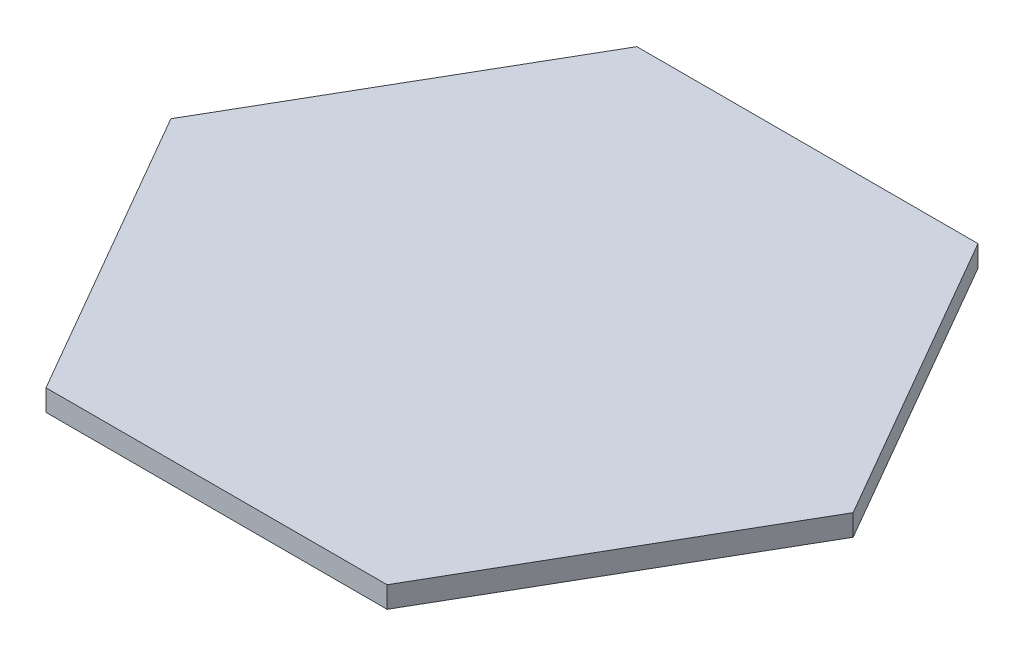
ISO-10303-21;
HEADER;
FILE_DESCRIPTION(('STEP AP214'),'2;1');
FILE_NAME('part.step','',(''),(''),'','','');
FILE_SCHEMA(('AUTOMOTIVE_DESIGN { 1 0 10303 214 1 1 1 1 }'));
ENDSEC;
DATA;
#1=APPLICATION_CONTEXT('core data for automotive mechanical design processes');
#2=APPLICATION_PROTOCOL_DEFINITION('international standard','automotive_design',2000,#1);
#3=PRODUCT_CONTEXT('',#1,'mechanical');
#4=PRODUCT('Part','Part','',(#3));
#5=PRODUCT_RELATED_PRODUCT_CATEGORY('part','',(#4));
#6=PRODUCT_DEFINITION_FORMATION('','',#4);
#7=PRODUCT_DEFINITION_CONTEXT('part definition',#1,'design');
#8=PRODUCT_DEFINITION('design','',#6,#7);
#9=PRODUCT_DEFINITION_SHAPE('','',#8);
#10=(LENGTH_UNIT() NAMED_UNIT(*) SI_UNIT(.MILLI.,.METRE.));
#11=(NAMED_UNIT(*) PLANE_ANGLE_UNIT() SI_UNIT($,.RADIAN.));
#12=(NAMED_UNIT(*) SI_UNIT($,.STERADIAN.) SOLID_ANGLE_UNIT());
#13=UNCERTAINTY_MEASURE_WITH_UNIT(LENGTH_MEASURE(1.E-05),#10,'distance_accuracy_value','');
#14=(GEOMETRIC_REPRESENTATION_CONTEXT(3) GLOBAL_UNCERTAINTY_ASSIGNED_CONTEXT((#13)) GLOBAL_UNIT_ASSIGNED_CONTEXT((#10,
#11,#12)) REPRESENTATION_CONTEXT('',''));
#15=CARTESIAN_POINT('',(0.,0.,0.));
#16=DIRECTION('',(0.,0.,1.));
#17=DIRECTION('',(1.,0.,0.));
#18=AXIS2_PLACEMENT_3D('',#15,#16,#17);
#19=CARTESIAN_POINT('',(25.4,3.175,43.9940905122495));
#20=DIRECTION('',(-0.866025403784439,0.,-0.5));
#21=DIRECTION('',(-0.5,0.,0.866025403784439));
#22=AXIS2_PLACEMENT_3D('',#19,#20,#21);
#23=PLANE('',#22);
#24=DIRECTION('',(0.5,0.,-0.866025403784439));
#25=VECTOR('',#24,1.);
#26=CARTESIAN_POINT('',(25.4,0.,43.9940905122495));
#27=LINE('',#26,#25);
#28=CARTESIAN_POINT('',(25.4,0.,43.9940905122495));
#29=VERTEX_POINT('',#28);
#30=CARTESIAN_POINT('',(50.8,0.,0.));
#31=VERTEX_POINT('',#30);
#32=EDGE_CURVE('E119',#29,#31,#27,.T.);
#33=ORIENTED_EDGE('',*,*,#32,.T.);
#34=DIRECTION('',(0.,-1.,0.));
#35=VECTOR('',#34,1.);
#36=CARTESIAN_POINT('',(50.8,3.175,0.));
#37=LINE('',#36,#35);
#38=CARTESIAN_POINT('',(50.8,3.175,0.));
#39=VERTEX_POINT('',#38);
#40=EDGE_CURVE('E11',#39,#31,#37,.T.);
#41=ORIENTED_EDGE('',*,*,#40,.F.);
#42=DIRECTION('',(0.5,0.,-0.866025403784439));
#43=VECTOR('',#42,1.);
#44=CARTESIAN_POINT('',(25.4,3.175,43.9940905122495));
#45=LINE('',#44,#43);
#46=CARTESIAN_POINT('',(25.4,3.175,43.9940905122495));
#47=VERTEX_POINT('',#46);
#48=EDGE_CURVE('E129',#47,#39,#45,.T.);
#49=ORIENTED_EDGE('',*,*,#48,.F.);
#50=DIRECTION('',(0.,-1.,0.));
#51=VECTOR('',#50,1.);
#52=CARTESIAN_POINT('',(25.4,3.175,43.9940905122495));
#53=LINE('',#52,#51);
#54=EDGE_CURVE('E115',#47,#29,#53,.T.);
#55=ORIENTED_EDGE('',*,*,#54,.T.);
#56=EDGE_LOOP('',(#33,#41,#49,#55));
#57=FACE_BOUND('',#56,.T.);
#58=ADVANCED_FACE('F35',(#57),#23,.F.);
#59=CARTESIAN_POINT('',(50.8,3.175,0.));
#60=DIRECTION('',(-0.866025403784439,0.,0.5));
#61=DIRECTION('',(0.5,0.,0.866025403784439));
#62=AXIS2_PLACEMENT_3D('',#59,#60,#61);
#63=PLANE('',#62);
#64=DIRECTION('',(-0.5,0.,-0.866025403784439));
#65=VECTOR('',#64,1.);
#66=CARTESIAN_POINT('',(50.8,0.,0.));
#67=LINE('',#66,#65);
#68=CARTESIAN_POINT('',(25.4,0.,-43.9940905122495));
#69=VERTEX_POINT('',#68);
#70=EDGE_CURVE('E122',#31,#69,#67,.T.);
#71=ORIENTED_EDGE('',*,*,#70,.T.);
#72=DIRECTION('',(0.,-1.,0.));
#73=VECTOR('',#72,1.);
#74=CARTESIAN_POINT('',(25.4,3.175,-43.9940905122495));
#75=LINE('',#74,#73);
#76=CARTESIAN_POINT('',(25.4,3.175,-43.9940905122495));
#77=VERTEX_POINT('',#76);
#78=EDGE_CURVE('E43',#77,#69,#75,.T.);
#79=ORIENTED_EDGE('',*,*,#78,.F.);
#80=DIRECTION('',(-0.5,0.,-0.866025403784439));
#81=VECTOR('',#80,1.);
#82=CARTESIAN_POINT('',(50.8,3.175,0.));
#83=LINE('',#82,#81);
#84=EDGE_CURVE('E88',#39,#77,#83,.T.);
#85=ORIENTED_EDGE('',*,*,#84,.F.);
#86=ORIENTED_EDGE('',*,*,#40,.T.);
#87=EDGE_LOOP('',(#71,#79,#85,#86));
#88=FACE_BOUND('',#87,.T.);
#89=ADVANCED_FACE('F153',(#88),#63,.F.);
#90=CARTESIAN_POINT('',(25.4,3.175,-43.9940905122495));
#91=DIRECTION('',(0.,0.,1.));
#92=DIRECTION('',(1.,0.,0.));
#93=AXIS2_PLACEMENT_3D('',#90,#91,#92);
#94=PLANE('',#93);
#95=DIRECTION('',(-1.,0.,0.));
#96=VECTOR('',#95,1.);
#97=CARTESIAN_POINT('',(25.4,0.,-43.9940905122495));
#98=LINE('',#97,#96);
#99=CARTESIAN_POINT('',(-25.4,0.,-43.9940905122495));
#100=VERTEX_POINT('',#99);
#101=EDGE_CURVE('E124',#69,#100,#98,.T.);
#102=ORIENTED_EDGE('',*,*,#101,.T.);
#103=DIRECTION('',(0.,-1.,0.));
#104=VECTOR('',#103,1.);
#105=CARTESIAN_POINT('',(-25.4,3.175,-43.9940905122495));
#106=LINE('',#105,#104);
#107=CARTESIAN_POINT('',(-25.4,3.175,-43.9940905122495));
#108=VERTEX_POINT('',#107);
#109=EDGE_CURVE('E110',#108,#100,#106,.T.);
#110=ORIENTED_EDGE('',*,*,#109,.F.);
#111=DIRECTION('',(-1.,0.,0.));
#112=VECTOR('',#111,1.);
#113=CARTESIAN_POINT('',(25.4,3.175,-43.9940905122495));
#114=LINE('',#113,#112);
#115=EDGE_CURVE('E101',#77,#108,#114,.T.);
#116=ORIENTED_EDGE('',*,*,#115,.F.);
#117=ORIENTED_EDGE('',*,*,#78,.T.);
#118=EDGE_LOOP('',(#102,#110,#116,#117));
#119=FACE_BOUND('',#118,.T.);
#120=ADVANCED_FACE('F135',(#119),#94,.F.);
#121=CARTESIAN_POINT('',(-25.4,3.175,-43.9940905122495));
#122=DIRECTION('',(0.866025403784439,0.,0.5));
#123=DIRECTION('',(0.5,0.,-0.866025403784439));
#124=AXIS2_PLACEMENT_3D('',#121,#122,#123);
#125=PLANE('',#124);
#126=DIRECTION('',(-0.5,0.,0.866025403784439));
#127=VECTOR('',#126,1.);
#128=CARTESIAN_POINT('',(-25.4,0.,-43.9940905122495));
#129=LINE('',#128,#127);
#130=CARTESIAN_POINT('',(-50.8,0.,0.));
#131=VERTEX_POINT('',#130);
#132=EDGE_CURVE('E109',#100,#131,#129,.T.);
#133=ORIENTED_EDGE('',*,*,#132,.T.);
#134=DIRECTION('',(0.,-1.,0.));
#135=VECTOR('',#134,1.);
#136=CARTESIAN_POINT('',(-50.8,3.175,0.));
#137=LINE('',#136,#135);
#138=CARTESIAN_POINT('',(-50.8,3.175,0.));
#139=VERTEX_POINT('',#138);
#140=EDGE_CURVE('E106',#139,#131,#137,.T.);
#141=ORIENTED_EDGE('',*,*,#140,.F.);
#142=DIRECTION('',(-0.5,0.,0.866025403784439));
#143=VECTOR('',#142,1.);
#144=CARTESIAN_POINT('',(-25.4,3.175,-43.9940905122495));
#145=LINE('',#144,#143);
#146=EDGE_CURVE('E95',#108,#139,#145,.T.);
#147=ORIENTED_EDGE('',*,*,#146,.F.);
#148=ORIENTED_EDGE('',*,*,#109,.T.);
#149=EDGE_LOOP('',(#133,#141,#147,#148));
#150=FACE_BOUND('',#149,.T.);
#151=ADVANCED_FACE('F107',(#150),#125,.F.);
#152=CARTESIAN_POINT('',(-50.8,3.175,0.));
#153=DIRECTION('',(0.866025403784439,0.,-0.5));
#154=DIRECTION('',(-0.5,0.,-0.866025403784439));
#155=AXIS2_PLACEMENT_3D('',#152,#153,#154);
#156=PLANE('',#155);
#157=DIRECTION('',(0.5,0.,0.866025403784438));
#158=VECTOR('',#157,1.);
#159=CARTESIAN_POINT('',(-50.8,0.,0.));
#160=LINE('',#159,#158);
#161=CARTESIAN_POINT('',(-25.4,0.,43.9940905122495));
#162=VERTEX_POINT('',#161);
#163=EDGE_CURVE('E74',#131,#162,#160,.T.);
#164=ORIENTED_EDGE('',*,*,#163,.T.);
#165=DIRECTION('',(0.,-1.,0.));
#166=VECTOR('',#165,1.);
#167=CARTESIAN_POINT('',(-25.4,3.175,43.9940905122495));
#168=LINE('',#167,#166);
#169=CARTESIAN_POINT('',(-25.4,3.175,43.9940905122495));
#170=VERTEX_POINT('',#169);
#171=EDGE_CURVE('E111',#170,#162,#168,.T.);
#172=ORIENTED_EDGE('',*,*,#171,.F.);
#173=DIRECTION('',(0.5,0.,0.866025403784438));
#174=VECTOR('',#173,1.);
#175=CARTESIAN_POINT('',(-50.8,3.175,0.));
#176=LINE('',#175,#174);
#177=EDGE_CURVE('E99',#139,#170,#176,.T.);
#178=ORIENTED_EDGE('',*,*,#177,.F.);
#179=ORIENTED_EDGE('',*,*,#140,.T.);
#180=EDGE_LOOP('',(#164,#172,#178,#179));
#181=FACE_BOUND('',#180,.T.);
#182=ADVANCED_FACE('F113',(#181),#156,.F.);
#183=CARTESIAN_POINT('',(-25.4,3.175,43.9940905122495));
#184=DIRECTION('',(0.,0.,-1.));
#185=DIRECTION('',(-1.,0.,0.));
#186=AXIS2_PLACEMENT_3D('',#183,#184,#185);
#187=PLANE('',#186);
#188=DIRECTION('',(1.,0.,0.));
#189=VECTOR('',#188,1.);
#190=CARTESIAN_POINT('',(-25.4,0.,43.9940905122495));
#191=LINE('',#190,#189);
#192=EDGE_CURVE('E80',#162,#29,#191,.T.);
#193=ORIENTED_EDGE('',*,*,#192,.T.);
#194=ORIENTED_EDGE('',*,*,#54,.F.);
#195=DIRECTION('',(1.,0.,0.));
#196=VECTOR('',#195,1.);
#197=CARTESIAN_POINT('',(-25.4,3.175,43.9940905122495));
#198=LINE('',#197,#196);
#199=EDGE_CURVE('E51',#170,#47,#198,.T.);
#200=ORIENTED_EDGE('',*,*,#199,.F.);
#201=ORIENTED_EDGE('',*,*,#171,.T.);
#202=EDGE_LOOP('',(#193,#194,#200,#201));
#203=FACE_BOUND('',#202,.T.);
#204=ADVANCED_FACE('F142',(#203),#187,.F.);
#205=CARTESIAN_POINT('',(0.,3.175,0.));
#206=DIRECTION('',(0.,1.,0.));
#207=DIRECTION('',(0.,0.,1.));
#208=AXIS2_PLACEMENT_3D('',#205,#206,#207);
#209=PLANE('',#208);
#210=ORIENTED_EDGE('',*,*,#48,.T.);
#211=ORIENTED_EDGE('',*,*,#84,.T.);
#212=ORIENTED_EDGE('',*,*,#115,.T.);
#213=ORIENTED_EDGE('',*,*,#146,.T.);
#214=ORIENTED_EDGE('',*,*,#177,.T.);
#215=ORIENTED_EDGE('',*,*,#199,.T.);
#216=EDGE_LOOP('',(#210,#211,#212,#213,#214,#215));
#217=FACE_BOUND('',#216,.T.);
#218=ADVANCED_FACE('F97',(#217),#209,.T.);
#219=CARTESIAN_POINT('',(0.,0.,0.));
#220=DIRECTION('',(0.,1.,0.));
#221=DIRECTION('',(0.,0.,1.));
#222=AXIS2_PLACEMENT_3D('',#219,#220,#221);
#223=PLANE('',#222);
#224=ORIENTED_EDGE('',*,*,#32,.F.);
#225=ORIENTED_EDGE('',*,*,#192,.F.);
#226=ORIENTED_EDGE('',*,*,#163,.F.);
#227=ORIENTED_EDGE('',*,*,#132,.F.);
#228=ORIENTED_EDGE('',*,*,#101,.F.);
#229=ORIENTED_EDGE('',*,*,#70,.F.);
#230=EDGE_LOOP('',(#224,#225,#226,#227,#228,#229));
#231=FACE_BOUND('',#230,.T.);
#232=ADVANCED_FACE('F138',(#231),#223,.F.);
#233=CLOSED_SHELL('',(#58,#89,#120,#151,#182,#204,#218,#232));
#234=MANIFOLD_SOLID_BREP('B2',#233);
#235=ADVANCED_BREP_SHAPE_REPRESENTATION('',(#18,#234),#14);
#236=SHAPE_DEFINITION_REPRESENTATION(#9,#235);
ENDSEC;
END-ISO-10303-21;
